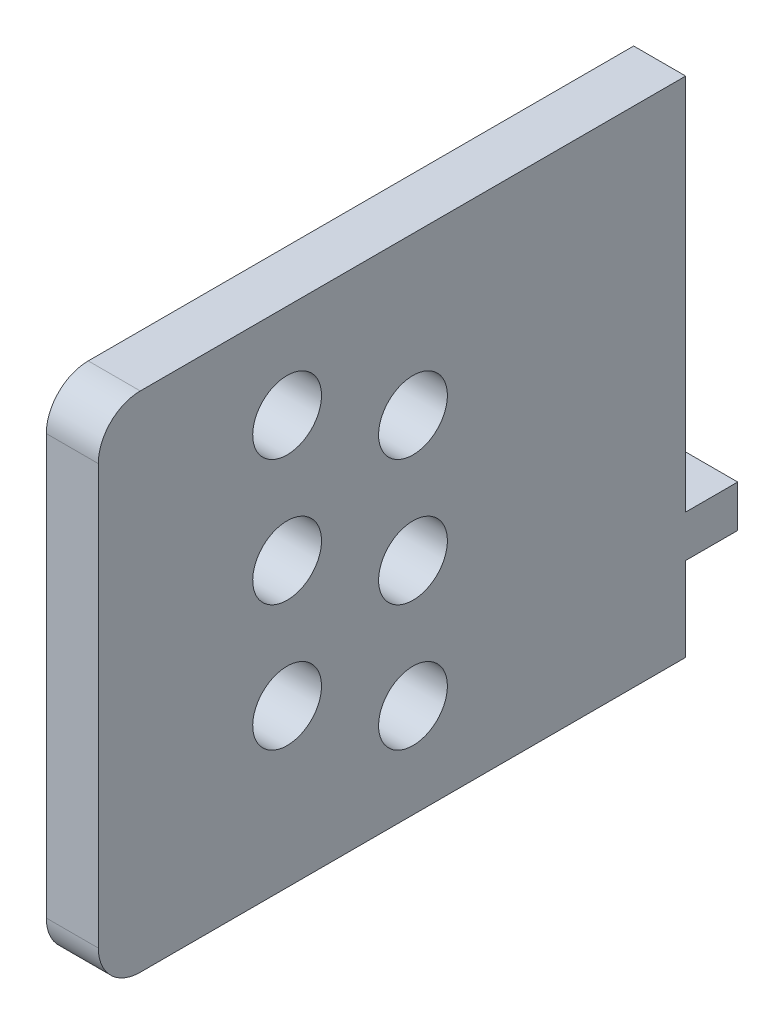
ISO-10303-21;
HEADER;
FILE_DESCRIPTION(('STEP AP214'),'2;1');
FILE_NAME('part.step','',(''),(''),'','','');
FILE_SCHEMA(('AUTOMOTIVE_DESIGN { 1 0 10303 214 1 1 1 1 }'));
ENDSEC;
DATA;
#1=APPLICATION_CONTEXT('core data for automotive mechanical design processes');
#2=APPLICATION_PROTOCOL_DEFINITION('international standard','automotive_design',2000,#1);
#3=PRODUCT_CONTEXT('',#1,'mechanical');
#4=PRODUCT('Part','Part','',(#3));
#5=PRODUCT_RELATED_PRODUCT_CATEGORY('part','',(#4));
#6=PRODUCT_DEFINITION_FORMATION('','',#4);
#7=PRODUCT_DEFINITION_CONTEXT('part definition',#1,'design');
#8=PRODUCT_DEFINITION('design','',#6,#7);
#9=PRODUCT_DEFINITION_SHAPE('','',#8);
#10=(LENGTH_UNIT() NAMED_UNIT(*) SI_UNIT(.MILLI.,.METRE.));
#11=(NAMED_UNIT(*) PLANE_ANGLE_UNIT() SI_UNIT($,.RADIAN.));
#12=(NAMED_UNIT(*) SI_UNIT($,.STERADIAN.) SOLID_ANGLE_UNIT());
#13=UNCERTAINTY_MEASURE_WITH_UNIT(LENGTH_MEASURE(1.E-05),#10,'distance_accuracy_value','');
#14=(GEOMETRIC_REPRESENTATION_CONTEXT(3) GLOBAL_UNCERTAINTY_ASSIGNED_CONTEXT((#13)) GLOBAL_UNIT_ASSIGNED_CONTEXT((#10,
#11,#12)) REPRESENTATION_CONTEXT('',''));
#15=CARTESIAN_POINT('',(0.,0.,0.));
#16=DIRECTION('',(0.,0.,1.));
#17=DIRECTION('',(1.,0.,0.));
#18=AXIS2_PLACEMENT_3D('',#15,#16,#17);
#19=CARTESIAN_POINT('',(0.,0.,0.));
#20=DIRECTION('',(0.,0.,1.));
#21=DIRECTION('',(1.,0.,0.));
#22=AXIS2_PLACEMENT_3D('',#19,#20,#21);
#23=PLANE('',#22);
#24=DIRECTION('',(0.,-1.,0.));
#25=VECTOR('',#24,1.);
#26=CARTESIAN_POINT('',(0.,76.2,0.));
#27=LINE('',#26,#25);
#28=CARTESIAN_POINT('',(0.,12.7,0.));
#29=VERTEX_POINT('',#28);
#30=CARTESIAN_POINT('',(0.,0.,0.));
#31=VERTEX_POINT('',#30);
#32=EDGE_CURVE('E113',#29,#31,#27,.T.);
#33=ORIENTED_EDGE('',*,*,#32,.F.);
#34=DIRECTION('',(1.,0.,0.));
#35=VECTOR('',#34,1.);
#36=CARTESIAN_POINT('',(0.,12.7,0.));
#37=LINE('',#36,#35);
#38=CARTESIAN_POINT('',(7.87399999999999,12.7,0.));
#39=VERTEX_POINT('',#38);
#40=EDGE_CURVE('E123',#29,#39,#37,.T.);
#41=ORIENTED_EDGE('',*,*,#40,.T.);
#42=DIRECTION('',(0.,1.,0.));
#43=VECTOR('',#42,1.);
#44=CARTESIAN_POINT('',(7.87399999999996,76.2,0.));
#45=LINE('',#44,#43);
#46=CARTESIAN_POINT('',(7.87399999999999,0.,0.));
#47=VERTEX_POINT('',#46);
#48=EDGE_CURVE('E143',#47,#39,#45,.T.);
#49=ORIENTED_EDGE('',*,*,#48,.F.);
#50=DIRECTION('',(1.,0.,0.));
#51=VECTOR('',#50,1.);
#52=CARTESIAN_POINT('',(0.,0.,0.));
#53=LINE('',#52,#51);
#54=EDGE_CURVE('E132',#31,#47,#53,.T.);
#55=ORIENTED_EDGE('',*,*,#54,.F.);
#56=EDGE_LOOP('',(#33,#41,#49,#55));
#57=FACE_BOUND('',#56,.T.);
#58=ADVANCED_FACE('F32',(#57),#23,.F.);
#59=CARTESIAN_POINT('',(0.,76.2,88.9));
#60=DIRECTION('',(1.,0.,0.));
#61=DIRECTION('',(0.,1.,0.));
#62=AXIS2_PLACEMENT_3D('',#59,#60,#61);
#63=PLANE('',#62);
#64=CARTESIAN_POINT('',(0.,14.2875,41.275));
#65=DIRECTION('',(-1.,0.,0.));
#66=DIRECTION('',(0.,-1.,0.));
#67=AXIS2_PLACEMENT_3D('',#64,#65,#66);
#68=CIRCLE('',#67,5.207);
#69=CARTESIAN_POINT('',(0.,9.0805,41.275));
#70=VERTEX_POINT('',#69);
#71=EDGE_CURVE('E171',#70,#70,#68,.T.);
#72=ORIENTED_EDGE('',*,*,#71,.F.);
#73=EDGE_LOOP('',(#72));
#74=FACE_BOUND('',#73,.T.);
#75=CARTESIAN_POINT('',(0.,52.3875,41.275));
#76=DIRECTION('',(-1.,0.,0.));
#77=DIRECTION('',(0.,-1.,0.));
#78=AXIS2_PLACEMENT_3D('',#75,#76,#77);
#79=CIRCLE('',#78,5.207);
#80=CARTESIAN_POINT('',(0.,47.1805,41.275));
#81=VERTEX_POINT('',#80);
#82=EDGE_CURVE('E177',#81,#81,#79,.T.);
#83=ORIENTED_EDGE('',*,*,#82,.F.);
#84=EDGE_LOOP('',(#83));
#85=FACE_BOUND('',#84,.T.);
#86=CARTESIAN_POINT('',(0.,33.3375,41.275));
#87=DIRECTION('',(-1.,0.,0.));
#88=DIRECTION('',(0.,-1.,0.));
#89=AXIS2_PLACEMENT_3D('',#86,#87,#88);
#90=CIRCLE('',#89,5.207);
#91=CARTESIAN_POINT('',(0.,28.1305,41.275));
#92=VERTEX_POINT('',#91);
#93=EDGE_CURVE('E183',#92,#92,#90,.T.);
#94=ORIENTED_EDGE('',*,*,#93,.F.);
#95=EDGE_LOOP('',(#94));
#96=FACE_BOUND('',#95,.T.);
#97=CARTESIAN_POINT('',(0.,61.9125,60.325));
#98=DIRECTION('',(-1.,0.,0.));
#99=DIRECTION('',(0.,-1.,0.));
#100=AXIS2_PLACEMENT_3D('',#97,#98,#99);
#101=CIRCLE('',#100,5.20700000000001);
#102=CARTESIAN_POINT('',(0.,56.7055,60.325));
#103=VERTEX_POINT('',#102);
#104=EDGE_CURVE('E189',#103,#103,#101,.T.);
#105=ORIENTED_EDGE('',*,*,#104,.F.);
#106=EDGE_LOOP('',(#105));
#107=FACE_BOUND('',#106,.T.);
#108=CARTESIAN_POINT('',(0.,42.8625,60.325));
#109=DIRECTION('',(-1.,0.,0.));
#110=DIRECTION('',(0.,-1.,0.));
#111=AXIS2_PLACEMENT_3D('',#108,#109,#110);
#112=CIRCLE('',#111,5.20700000000001);
#113=CARTESIAN_POINT('',(0.,37.6555,60.325));
#114=VERTEX_POINT('',#113);
#115=EDGE_CURVE('E195',#114,#114,#112,.T.);
#116=ORIENTED_EDGE('',*,*,#115,.F.);
#117=EDGE_LOOP('',(#116));
#118=FACE_BOUND('',#117,.T.);
#119=CARTESIAN_POINT('',(0.,23.8125,60.325));
#120=DIRECTION('',(-1.,0.,0.));
#121=DIRECTION('',(0.,-1.,0.));
#122=AXIS2_PLACEMENT_3D('',#119,#120,#121);
#123=CIRCLE('',#122,5.20700000000001);
#124=CARTESIAN_POINT('',(0.,18.6055,60.325));
#125=VERTEX_POINT('',#124);
#126=EDGE_CURVE('E139',#125,#125,#123,.T.);
#127=ORIENTED_EDGE('',*,*,#126,.F.);
#128=EDGE_LOOP('',(#127));
#129=FACE_BOUND('',#128,.T.);
#130=DIRECTION('',(0.,0.,-1.));
#131=VECTOR('',#130,1.);
#132=CARTESIAN_POINT('',(0.,0.,88.9));
#133=LINE('',#132,#131);
#134=CARTESIAN_POINT('',(0.,0.,82.55));
#135=VERTEX_POINT('',#134);
#136=EDGE_CURVE('E290',#135,#31,#133,.T.);
#137=ORIENTED_EDGE('',*,*,#136,.F.);
#138=CARTESIAN_POINT('',(0.,6.35,82.55));
#139=DIRECTION('',(1.,0.,0.));
#140=DIRECTION('',(0.,1.,0.));
#141=AXIS2_PLACEMENT_3D('',#138,#139,#140);
#142=CIRCLE('',#141,6.35);
#143=CARTESIAN_POINT('',(0.,6.35000000000002,88.9));
#144=VERTEX_POINT('',#143);
#145=EDGE_CURVE('E41',#135,#144,#142,.F.);
#146=ORIENTED_EDGE('',*,*,#145,.T.);
#147=DIRECTION('',(0.,-1.,0.));
#148=VECTOR('',#147,1.);
#149=CARTESIAN_POINT('',(0.,76.2,88.9));
#150=LINE('',#149,#148);
#151=CARTESIAN_POINT('',(0.,69.85,88.9));
#152=VERTEX_POINT('',#151);
#153=EDGE_CURVE('E280',#152,#144,#150,.T.);
#154=ORIENTED_EDGE('',*,*,#153,.F.);
#155=CARTESIAN_POINT('',(0.,69.85,82.55));
#156=DIRECTION('',(1.,0.,0.));
#157=DIRECTION('',(0.,1.,0.));
#158=AXIS2_PLACEMENT_3D('',#155,#156,#157);
#159=CIRCLE('',#158,6.35);
#160=CARTESIAN_POINT('',(0.,76.2,82.55));
#161=VERTEX_POINT('',#160);
#162=EDGE_CURVE('E57',#152,#161,#159,.F.);
#163=ORIENTED_EDGE('',*,*,#162,.T.);
#164=DIRECTION('',(0.,0.,-1.));
#165=VECTOR('',#164,1.);
#166=CARTESIAN_POINT('',(0.,76.2,88.9));
#167=LINE('',#166,#165);
#168=CARTESIAN_POINT('',(0.,76.2,0.));
#169=VERTEX_POINT('',#168);
#170=EDGE_CURVE('E279',#161,#169,#167,.T.);
#171=ORIENTED_EDGE('',*,*,#170,.T.);
#172=CARTESIAN_POINT('',(0.,19.05,0.));
#173=VERTEX_POINT('',#172);
#174=EDGE_CURVE('E133',#169,#173,#27,.T.);
#175=ORIENTED_EDGE('',*,*,#174,.T.);
#176=DIRECTION('',(0.,0.,1.));
#177=VECTOR('',#176,1.);
#178=CARTESIAN_POINT('',(0.,19.05,-7.874));
#179=LINE('',#178,#177);
#180=CARTESIAN_POINT('',(0.,19.05,-7.874));
#181=VERTEX_POINT('',#180);
#182=EDGE_CURVE('E49',#181,#173,#179,.T.);
#183=ORIENTED_EDGE('',*,*,#182,.F.);
#184=DIRECTION('',(0.,-1.,0.));
#185=VECTOR('',#184,1.);
#186=CARTESIAN_POINT('',(0.,19.05,-7.874));
#187=LINE('',#186,#185);
#188=CARTESIAN_POINT('',(0.,12.7,-7.874));
#189=VERTEX_POINT('',#188);
#190=EDGE_CURVE('E116',#181,#189,#187,.T.);
#191=ORIENTED_EDGE('',*,*,#190,.T.);
#192=DIRECTION('',(0.,0.,1.));
#193=VECTOR('',#192,1.);
#194=CARTESIAN_POINT('',(0.,12.7,-7.874));
#195=LINE('',#194,#193);
#196=EDGE_CURVE('E109',#189,#29,#195,.T.);
#197=ORIENTED_EDGE('',*,*,#196,.T.);
#198=ORIENTED_EDGE('',*,*,#32,.T.);
#199=EDGE_LOOP('',(#137,#146,#154,#163,#171,#175,#183,#191,#197,#198));
#200=FACE_BOUND('',#199,.T.);
#201=ADVANCED_FACE('F34',(#74,#85,#96,#107,#118,#129,#200),#63,.F.);
#202=CARTESIAN_POINT('',(0.,0.,88.9));
#203=DIRECTION('',(0.,1.,0.));
#204=DIRECTION('',(0.,0.,1.));
#205=AXIS2_PLACEMENT_3D('',#202,#203,#204);
#206=PLANE('',#205);
#207=DIRECTION('',(0.,0.,-1.));
#208=VECTOR('',#207,1.);
#209=CARTESIAN_POINT('',(7.87399999999999,0.,88.9));
#210=LINE('',#209,#208);
#211=CARTESIAN_POINT('',(7.87399999999999,0.,82.55));
#212=VERTEX_POINT('',#211);
#213=EDGE_CURVE('E288',#212,#47,#210,.T.);
#214=ORIENTED_EDGE('',*,*,#213,.F.);
#215=DIRECTION('',(1.,0.,0.));
#216=VECTOR('',#215,1.);
#217=CARTESIAN_POINT('',(0.,0.,82.55));
#218=LINE('',#217,#216);
#219=EDGE_CURVE('E298',#212,#135,#218,.F.);
#220=ORIENTED_EDGE('',*,*,#219,.T.);
#221=ORIENTED_EDGE('',*,*,#136,.T.);
#222=ORIENTED_EDGE('',*,*,#54,.T.);
#223=EDGE_LOOP('',(#214,#220,#221,#222));
#224=FACE_BOUND('',#223,.T.);
#225=ADVANCED_FACE('F206',(#224),#206,.F.);
#226=CARTESIAN_POINT('',(7.87399999999996,76.2,88.9));
#227=DIRECTION('',(-1.,0.,0.));
#228=DIRECTION('',(0.,-1.,0.));
#229=AXIS2_PLACEMENT_3D('',#226,#227,#228);
#230=PLANE('',#229);
#231=CARTESIAN_POINT('',(7.87400000000001,14.2875,41.275));
#232=DIRECTION('',(-1.,0.,0.));
#233=DIRECTION('',(0.,-1.,0.));
#234=AXIS2_PLACEMENT_3D('',#231,#232,#233);
#235=CIRCLE('',#234,5.207);
#236=CARTESIAN_POINT('',(7.87400000000002,9.0805,41.275));
#237=VERTEX_POINT('',#236);
#238=EDGE_CURVE('E174',#237,#237,#235,.T.);
#239=ORIENTED_EDGE('',*,*,#238,.T.);
#240=EDGE_LOOP('',(#239));
#241=FACE_BOUND('',#240,.T.);
#242=CARTESIAN_POINT('',(7.874,52.3875,41.275));
#243=DIRECTION('',(-1.,0.,0.));
#244=DIRECTION('',(0.,-1.,0.));
#245=AXIS2_PLACEMENT_3D('',#242,#243,#244);
#246=CIRCLE('',#245,5.207);
#247=CARTESIAN_POINT('',(7.874,47.1805,41.275));
#248=VERTEX_POINT('',#247);
#249=EDGE_CURVE('E180',#248,#248,#246,.T.);
#250=ORIENTED_EDGE('',*,*,#249,.T.);
#251=EDGE_LOOP('',(#250));
#252=FACE_BOUND('',#251,.T.);
#253=CARTESIAN_POINT('',(7.87400000000001,33.3375,41.275));
#254=DIRECTION('',(-1.,0.,0.));
#255=DIRECTION('',(0.,-1.,0.));
#256=AXIS2_PLACEMENT_3D('',#253,#254,#255);
#257=CIRCLE('',#256,5.207);
#258=CARTESIAN_POINT('',(7.87400000000001,28.1305,41.275));
#259=VERTEX_POINT('',#258);
#260=EDGE_CURVE('E186',#259,#259,#257,.T.);
#261=ORIENTED_EDGE('',*,*,#260,.T.);
#262=EDGE_LOOP('',(#261));
#263=FACE_BOUND('',#262,.T.);
#264=CARTESIAN_POINT('',(7.874,61.9125,60.325));
#265=DIRECTION('',(-1.,0.,0.));
#266=DIRECTION('',(0.,-1.,0.));
#267=AXIS2_PLACEMENT_3D('',#264,#265,#266);
#268=CIRCLE('',#267,5.20700000000001);
#269=CARTESIAN_POINT('',(7.874,56.7055,60.325));
#270=VERTEX_POINT('',#269);
#271=EDGE_CURVE('E192',#270,#270,#268,.T.);
#272=ORIENTED_EDGE('',*,*,#271,.T.);
#273=EDGE_LOOP('',(#272));
#274=FACE_BOUND('',#273,.T.);
#275=CARTESIAN_POINT('',(7.874,42.8625,60.325));
#276=DIRECTION('',(-1.,0.,0.));
#277=DIRECTION('',(0.,-1.,0.));
#278=AXIS2_PLACEMENT_3D('',#275,#276,#277);
#279=CIRCLE('',#278,5.20700000000001);
#280=CARTESIAN_POINT('',(7.87400000000001,37.6555,60.325));
#281=VERTEX_POINT('',#280);
#282=EDGE_CURVE('E198',#281,#281,#279,.T.);
#283=ORIENTED_EDGE('',*,*,#282,.T.);
#284=EDGE_LOOP('',(#283));
#285=FACE_BOUND('',#284,.T.);
#286=CARTESIAN_POINT('',(7.87400000000001,23.8125,60.325));
#287=DIRECTION('',(-1.,0.,0.));
#288=DIRECTION('',(0.,-1.,0.));
#289=AXIS2_PLACEMENT_3D('',#286,#287,#288);
#290=CIRCLE('',#289,5.20700000000001);
#291=CARTESIAN_POINT('',(7.87400000000001,18.6055,60.325));
#292=VERTEX_POINT('',#291);
#293=EDGE_CURVE('E134',#292,#292,#290,.T.);
#294=ORIENTED_EDGE('',*,*,#293,.T.);
#295=EDGE_LOOP('',(#294));
#296=FACE_BOUND('',#295,.T.);
#297=DIRECTION('',(0.,1.,0.));
#298=VECTOR('',#297,1.);
#299=CARTESIAN_POINT('',(7.87399999999996,76.2,88.9));
#300=LINE('',#299,#298);
#301=CARTESIAN_POINT('',(7.87399999999999,6.35000000000002,88.9));
#302=VERTEX_POINT('',#301);
#303=CARTESIAN_POINT('',(7.87399999999997,69.85,88.9));
#304=VERTEX_POINT('',#303);
#305=EDGE_CURVE('E270',#302,#304,#300,.T.);
#306=ORIENTED_EDGE('',*,*,#305,.F.);
#307=CARTESIAN_POINT('',(7.87399999999999,6.35,82.55));
#308=DIRECTION('',(-1.,0.,0.));
#309=DIRECTION('',(0.,-1.,0.));
#310=AXIS2_PLACEMENT_3D('',#307,#308,#309);
#311=CIRCLE('',#310,6.35);
#312=EDGE_CURVE('E271',#302,#212,#311,.F.);
#313=ORIENTED_EDGE('',*,*,#312,.T.);
#314=ORIENTED_EDGE('',*,*,#213,.T.);
#315=ORIENTED_EDGE('',*,*,#48,.T.);
#316=DIRECTION('',(0.,0.,1.));
#317=VECTOR('',#316,1.);
#318=CARTESIAN_POINT('',(7.87399999999999,12.7,-7.874));
#319=LINE('',#318,#317);
#320=CARTESIAN_POINT('',(7.87399999999999,12.7,-7.874));
#321=VERTEX_POINT('',#320);
#322=EDGE_CURVE('E120',#321,#39,#319,.T.);
#323=ORIENTED_EDGE('',*,*,#322,.F.);
#324=DIRECTION('',(0.,1.,0.));
#325=VECTOR('',#324,1.);
#326=CARTESIAN_POINT('',(7.87399999999999,19.05,-7.874));
#327=LINE('',#326,#325);
#328=CARTESIAN_POINT('',(7.87399999999999,19.05,-7.874));
#329=VERTEX_POINT('',#328);
#330=EDGE_CURVE('E167',#321,#329,#327,.T.);
#331=ORIENTED_EDGE('',*,*,#330,.T.);
#332=DIRECTION('',(0.,0.,1.));
#333=VECTOR('',#332,1.);
#334=CARTESIAN_POINT('',(7.87399999999999,19.05,-7.874));
#335=LINE('',#334,#333);
#336=CARTESIAN_POINT('',(7.87399999999999,19.05,0.));
#337=VERTEX_POINT('',#336);
#338=EDGE_CURVE('E312',#329,#337,#335,.T.);
#339=ORIENTED_EDGE('',*,*,#338,.T.);
#340=CARTESIAN_POINT('',(7.87399999999996,76.2,0.));
#341=VERTEX_POINT('',#340);
#342=EDGE_CURVE('E150',#337,#341,#45,.T.);
#343=ORIENTED_EDGE('',*,*,#342,.T.);
#344=DIRECTION('',(0.,0.,-1.));
#345=VECTOR('',#344,1.);
#346=CARTESIAN_POINT('',(7.87399999999996,76.2,88.9));
#347=LINE('',#346,#345);
#348=CARTESIAN_POINT('',(7.87399999999996,76.2,82.55));
#349=VERTEX_POINT('',#348);
#350=EDGE_CURVE('E282',#349,#341,#347,.T.);
#351=ORIENTED_EDGE('',*,*,#350,.F.);
#352=CARTESIAN_POINT('',(7.87399999999997,69.85,82.55));
#353=DIRECTION('',(-1.,0.,0.));
#354=DIRECTION('',(0.,-1.,0.));
#355=AXIS2_PLACEMENT_3D('',#352,#353,#354);
#356=CIRCLE('',#355,6.35);
#357=EDGE_CURVE('E275',#349,#304,#356,.F.);
#358=ORIENTED_EDGE('',*,*,#357,.T.);
#359=EDGE_LOOP('',(#306,#313,#314,#315,#323,#331,#339,#343,#351,#358));
#360=FACE_BOUND('',#359,.T.);
#361=ADVANCED_FACE('F212',(#241,#252,#263,#274,#285,#296,#360),#230,.F.);
#362=CARTESIAN_POINT('',(0.,76.2,88.9));
#363=DIRECTION('',(0.,-1.,0.));
#364=DIRECTION('',(0.,0.,-1.));
#365=AXIS2_PLACEMENT_3D('',#362,#363,#364);
#366=PLANE('',#365);
#367=ORIENTED_EDGE('',*,*,#170,.F.);
#368=DIRECTION('',(-1.,0.,0.));
#369=VECTOR('',#368,1.);
#370=CARTESIAN_POINT('',(7.87399999999996,76.2,82.55));
#371=LINE('',#370,#369);
#372=EDGE_CURVE('E11',#161,#349,#371,.F.);
#373=ORIENTED_EDGE('',*,*,#372,.T.);
#374=ORIENTED_EDGE('',*,*,#350,.T.);
#375=DIRECTION('',(-1.,0.,0.));
#376=VECTOR('',#375,1.);
#377=CARTESIAN_POINT('',(0.,76.2,0.));
#378=LINE('',#377,#376);
#379=EDGE_CURVE('E153',#341,#169,#378,.T.);
#380=ORIENTED_EDGE('',*,*,#379,.T.);
#381=EDGE_LOOP('',(#367,#373,#374,#380));
#382=FACE_BOUND('',#381,.T.);
#383=ADVANCED_FACE('F248',(#382),#366,.F.);
#384=CARTESIAN_POINT('',(0.,0.,88.9));
#385=DIRECTION('',(0.,0.,1.));
#386=DIRECTION('',(1.,0.,0.));
#387=AXIS2_PLACEMENT_3D('',#384,#385,#386);
#388=PLANE('',#387);
#389=ORIENTED_EDGE('',*,*,#153,.T.);
#390=DIRECTION('',(1.,0.,0.));
#391=VECTOR('',#390,1.);
#392=CARTESIAN_POINT('',(7.87399999999999,6.35,88.9));
#393=LINE('',#392,#391);
#394=EDGE_CURVE('E294',#144,#302,#393,.T.);
#395=ORIENTED_EDGE('',*,*,#394,.T.);
#396=ORIENTED_EDGE('',*,*,#305,.T.);
#397=DIRECTION('',(-1.,0.,0.));
#398=VECTOR('',#397,1.);
#399=CARTESIAN_POINT('',(0.,69.85,88.9));
#400=LINE('',#399,#398);
#401=EDGE_CURVE('E292',#304,#152,#400,.T.);
#402=ORIENTED_EDGE('',*,*,#401,.T.);
#403=EDGE_LOOP('',(#389,#395,#396,#402));
#404=FACE_BOUND('',#403,.T.);
#405=ADVANCED_FACE('F244',(#404),#388,.T.);
#406=ORIENTED_EDGE('',*,*,#342,.F.);
#407=DIRECTION('',(-1.,0.,0.));
#408=VECTOR('',#407,1.);
#409=CARTESIAN_POINT('',(0.,19.05,0.));
#410=LINE('',#409,#408);
#411=EDGE_CURVE('E128',#337,#173,#410,.T.);
#412=ORIENTED_EDGE('',*,*,#411,.T.);
#413=ORIENTED_EDGE('',*,*,#174,.F.);
#414=ORIENTED_EDGE('',*,*,#379,.F.);
#415=EDGE_LOOP('',(#406,#412,#413,#414));
#416=FACE_BOUND('',#415,.T.);
#417=ADVANCED_FACE('F215',(#416),#23,.F.);
#418=CARTESIAN_POINT('',(7.87400000000001,23.8125,60.325));
#419=DIRECTION('',(-1.,0.,0.));
#420=DIRECTION('',(0.,-1.,0.));
#421=AXIS2_PLACEMENT_3D('',#418,#419,#420);
#422=CYLINDRICAL_SURFACE('',#421,5.20700000000001);
#423=ORIENTED_EDGE('',*,*,#293,.F.);
#424=EDGE_LOOP('',(#423));
#425=FACE_BOUND('',#424,.T.);
#426=ORIENTED_EDGE('',*,*,#126,.T.);
#427=EDGE_LOOP('',(#426));
#428=FACE_BOUND('',#427,.T.);
#429=ADVANCED_FACE('F203',(#425,#428),#422,.F.);
#430=CARTESIAN_POINT('',(7.874,42.8625,60.325));
#431=DIRECTION('',(-1.,0.,0.));
#432=DIRECTION('',(0.,-1.,0.));
#433=AXIS2_PLACEMENT_3D('',#430,#431,#432);
#434=CYLINDRICAL_SURFACE('',#433,5.20700000000001);
#435=ORIENTED_EDGE('',*,*,#282,.F.);
#436=EDGE_LOOP('',(#435));
#437=FACE_BOUND('',#436,.T.);
#438=ORIENTED_EDGE('',*,*,#115,.T.);
#439=EDGE_LOOP('',(#438));
#440=FACE_BOUND('',#439,.T.);
#441=ADVANCED_FACE('F226',(#437,#440),#434,.F.);
#442=CARTESIAN_POINT('',(7.874,61.9125,60.325));
#443=DIRECTION('',(-1.,0.,0.));
#444=DIRECTION('',(0.,-1.,0.));
#445=AXIS2_PLACEMENT_3D('',#442,#443,#444);
#446=CYLINDRICAL_SURFACE('',#445,5.20700000000001);
#447=ORIENTED_EDGE('',*,*,#271,.F.);
#448=EDGE_LOOP('',(#447));
#449=FACE_BOUND('',#448,.T.);
#450=ORIENTED_EDGE('',*,*,#104,.T.);
#451=EDGE_LOOP('',(#450));
#452=FACE_BOUND('',#451,.T.);
#453=ADVANCED_FACE('F228',(#449,#452),#446,.F.);
#454=CARTESIAN_POINT('',(7.87400000000001,33.3375,41.275));
#455=DIRECTION('',(-1.,0.,0.));
#456=DIRECTION('',(0.,-1.,0.));
#457=AXIS2_PLACEMENT_3D('',#454,#455,#456);
#458=CYLINDRICAL_SURFACE('',#457,5.207);
#459=ORIENTED_EDGE('',*,*,#260,.F.);
#460=EDGE_LOOP('',(#459));
#461=FACE_BOUND('',#460,.T.);
#462=ORIENTED_EDGE('',*,*,#93,.T.);
#463=EDGE_LOOP('',(#462));
#464=FACE_BOUND('',#463,.T.);
#465=ADVANCED_FACE('F235',(#461,#464),#458,.F.);
#466=CARTESIAN_POINT('',(7.874,52.3875,41.275));
#467=DIRECTION('',(-1.,0.,0.));
#468=DIRECTION('',(0.,-1.,0.));
#469=AXIS2_PLACEMENT_3D('',#466,#467,#468);
#470=CYLINDRICAL_SURFACE('',#469,5.207);
#471=ORIENTED_EDGE('',*,*,#249,.F.);
#472=EDGE_LOOP('',(#471));
#473=FACE_BOUND('',#472,.T.);
#474=ORIENTED_EDGE('',*,*,#82,.T.);
#475=EDGE_LOOP('',(#474));
#476=FACE_BOUND('',#475,.T.);
#477=ADVANCED_FACE('F339',(#473,#476),#470,.F.);
#478=CARTESIAN_POINT('',(7.87400000000001,14.2875,41.275));
#479=DIRECTION('',(-1.,0.,0.));
#480=DIRECTION('',(0.,-1.,0.));
#481=AXIS2_PLACEMENT_3D('',#478,#479,#480);
#482=CYLINDRICAL_SURFACE('',#481,5.207);
#483=ORIENTED_EDGE('',*,*,#238,.F.);
#484=EDGE_LOOP('',(#483));
#485=FACE_BOUND('',#484,.T.);
#486=ORIENTED_EDGE('',*,*,#71,.T.);
#487=EDGE_LOOP('',(#486));
#488=FACE_BOUND('',#487,.T.);
#489=ADVANCED_FACE('F333',(#485,#488),#482,.F.);
#490=CARTESIAN_POINT('',(0.,6.35,82.55));
#491=DIRECTION('',(-1.,0.,0.));
#492=DIRECTION('',(0.,0.,1.));
#493=AXIS2_PLACEMENT_3D('',#490,#491,#492);
#494=CYLINDRICAL_SURFACE('',#493,6.35);
#495=ORIENTED_EDGE('',*,*,#145,.F.);
#496=ORIENTED_EDGE('',*,*,#219,.F.);
#497=ORIENTED_EDGE('',*,*,#312,.F.);
#498=ORIENTED_EDGE('',*,*,#394,.F.);
#499=EDGE_LOOP('',(#495,#496,#497,#498));
#500=FACE_BOUND('',#499,.T.);
#501=ADVANCED_FACE('F305',(#500),#494,.T.);
#502=CARTESIAN_POINT('',(0.,69.85,82.55));
#503=DIRECTION('',(1.,0.,0.));
#504=DIRECTION('',(0.,0.,-1.));
#505=AXIS2_PLACEMENT_3D('',#502,#503,#504);
#506=CYLINDRICAL_SURFACE('',#505,6.35);
#507=ORIENTED_EDGE('',*,*,#357,.F.);
#508=ORIENTED_EDGE('',*,*,#372,.F.);
#509=ORIENTED_EDGE('',*,*,#162,.F.);
#510=ORIENTED_EDGE('',*,*,#401,.F.);
#511=EDGE_LOOP('',(#507,#508,#509,#510));
#512=FACE_BOUND('',#511,.T.);
#513=ADVANCED_FACE('F325',(#512),#506,.T.);
#514=CARTESIAN_POINT('',(0.,19.05,-7.874));
#515=DIRECTION('',(0.,1.,0.));
#516=DIRECTION('',(0.,0.,1.));
#517=AXIS2_PLACEMENT_3D('',#514,#515,#516);
#518=PLANE('',#517);
#519=ORIENTED_EDGE('',*,*,#411,.F.);
#520=ORIENTED_EDGE('',*,*,#338,.F.);
#521=DIRECTION('',(-1.,0.,0.));
#522=VECTOR('',#521,1.);
#523=CARTESIAN_POINT('',(0.,19.05,-7.874));
#524=LINE('',#523,#522);
#525=EDGE_CURVE('E121',#329,#181,#524,.T.);
#526=ORIENTED_EDGE('',*,*,#525,.T.);
#527=ORIENTED_EDGE('',*,*,#182,.T.);
#528=EDGE_LOOP('',(#519,#520,#526,#527));
#529=FACE_BOUND('',#528,.T.);
#530=ADVANCED_FACE('F316',(#529),#518,.T.);
#531=CARTESIAN_POINT('',(0.,12.7,-7.874));
#532=DIRECTION('',(0.,-1.,0.));
#533=DIRECTION('',(0.,0.,-1.));
#534=AXIS2_PLACEMENT_3D('',#531,#532,#533);
#535=PLANE('',#534);
#536=ORIENTED_EDGE('',*,*,#40,.F.);
#537=ORIENTED_EDGE('',*,*,#196,.F.);
#538=DIRECTION('',(1.,0.,0.));
#539=VECTOR('',#538,1.);
#540=CARTESIAN_POINT('',(0.,12.7,-7.874));
#541=LINE('',#540,#539);
#542=EDGE_CURVE('E165',#189,#321,#541,.T.);
#543=ORIENTED_EDGE('',*,*,#542,.T.);
#544=ORIENTED_EDGE('',*,*,#322,.T.);
#545=EDGE_LOOP('',(#536,#537,#543,#544));
#546=FACE_BOUND('',#545,.T.);
#547=ADVANCED_FACE('F124',(#546),#535,.T.);
#548=CARTESIAN_POINT('',(0.,12.7,-7.874));
#549=DIRECTION('',(0.,0.,1.));
#550=DIRECTION('',(1.,0.,0.));
#551=AXIS2_PLACEMENT_3D('',#548,#549,#550);
#552=PLANE('',#551);
#553=ORIENTED_EDGE('',*,*,#190,.F.);
#554=ORIENTED_EDGE('',*,*,#525,.F.);
#555=ORIENTED_EDGE('',*,*,#330,.F.);
#556=ORIENTED_EDGE('',*,*,#542,.F.);
#557=EDGE_LOOP('',(#553,#554,#555,#556));
#558=FACE_BOUND('',#557,.T.);
#559=ADVANCED_FACE('F315',(#558),#552,.F.);
#560=CLOSED_SHELL('',(#58,#201,#225,#361,#383,#405,#417,#429,#441,#453,#465,#477,#489,#501,#513,
#530,#547,#559));
#561=MANIFOLD_SOLID_BREP('B2',#560);
#562=ADVANCED_BREP_SHAPE_REPRESENTATION('',(#18,#561),#14);
#563=SHAPE_DEFINITION_REPRESENTATION(#9,#562);
ENDSEC;
END-ISO-10303-21;
